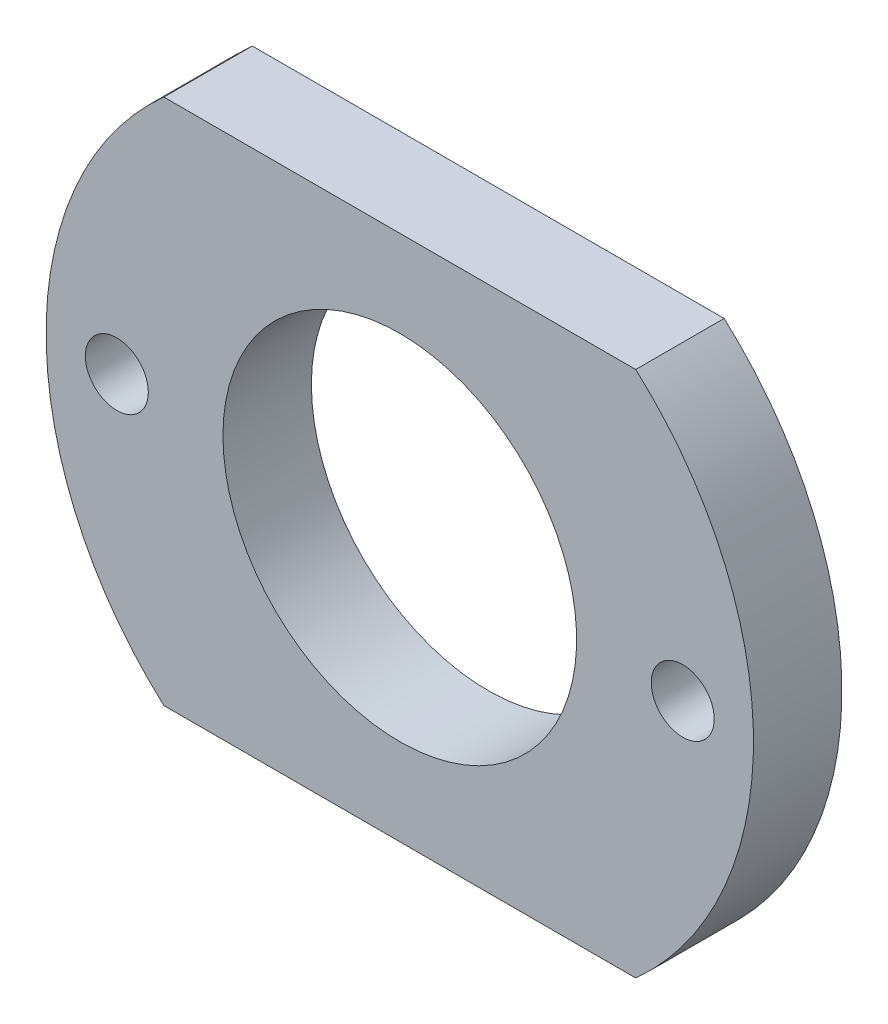
ISO-10303-21;
HEADER;
FILE_DESCRIPTION(('STEP AP214'),'2;1');
FILE_NAME('part.step','',(''),(''),'','','');
FILE_SCHEMA(('AUTOMOTIVE_DESIGN { 1 0 10303 214 1 1 1 1 }'));
ENDSEC;
DATA;
#1=APPLICATION_CONTEXT('core data for automotive mechanical design processes');
#2=APPLICATION_PROTOCOL_DEFINITION('international standard','automotive_design',2000,#1);
#3=PRODUCT_CONTEXT('',#1,'mechanical');
#4=PRODUCT('Part','Part','',(#3));
#5=PRODUCT_RELATED_PRODUCT_CATEGORY('part','',(#4));
#6=PRODUCT_DEFINITION_FORMATION('','',#4);
#7=PRODUCT_DEFINITION_CONTEXT('part definition',#1,'design');
#8=PRODUCT_DEFINITION('design','',#6,#7);
#9=PRODUCT_DEFINITION_SHAPE('','',#8);
#10=(LENGTH_UNIT() NAMED_UNIT(*) SI_UNIT(.MILLI.,.METRE.));
#11=(NAMED_UNIT(*) PLANE_ANGLE_UNIT() SI_UNIT($,.RADIAN.));
#12=(NAMED_UNIT(*) SI_UNIT($,.STERADIAN.) SOLID_ANGLE_UNIT());
#13=UNCERTAINTY_MEASURE_WITH_UNIT(LENGTH_MEASURE(1.E-05),#10,'distance_accuracy_value','');
#14=(GEOMETRIC_REPRESENTATION_CONTEXT(3) GLOBAL_UNCERTAINTY_ASSIGNED_CONTEXT((#13)) GLOBAL_UNIT_ASSIGNED_CONTEXT((#10,
#11,#12)) REPRESENTATION_CONTEXT('',''));
#15=CARTESIAN_POINT('',(0.,0.,0.));
#16=DIRECTION('',(0.,0.,1.));
#17=DIRECTION('',(1.,0.,0.));
#18=AXIS2_PLACEMENT_3D('',#15,#16,#17);
#19=CARTESIAN_POINT('',(0.,0.,3.175));
#20=DIRECTION('',(0.,0.,1.));
#21=DIRECTION('',(1.,0.,0.));
#22=AXIS2_PLACEMENT_3D('',#19,#20,#21);
#23=PLANE('',#22);
#24=CARTESIAN_POINT('',(0.,0.,3.175));
#25=DIRECTION('',(0.,0.,-1.));
#26=DIRECTION('',(-1.,0.,0.));
#27=AXIS2_PLACEMENT_3D('',#24,#25,#26);
#28=CIRCLE('',#27,6.35);
#29=CARTESIAN_POINT('',(-6.35,0.,3.175));
#30=VERTEX_POINT('',#29);
#31=EDGE_CURVE('E98',#30,#30,#28,.T.);
#32=ORIENTED_EDGE('',*,*,#31,.T.);
#33=EDGE_LOOP('',(#32));
#34=FACE_BOUND('',#33,.T.);
#35=CARTESIAN_POINT('',(0.,0.,3.175));
#36=DIRECTION('',(0.,0.,-1.));
#37=DIRECTION('',(-1.,0.,0.));
#38=AXIS2_PLACEMENT_3D('',#35,#36,#37);
#39=CIRCLE('',#38,12.7);
#40=CARTESIAN_POINT('',(8.47171870106651,9.4615,3.175));
#41=VERTEX_POINT('',#40);
#42=CARTESIAN_POINT('',(8.47171870106651,-9.4615,3.175));
#43=VERTEX_POINT('',#42);
#44=EDGE_CURVE('E55',#41,#43,#39,.T.);
#45=ORIENTED_EDGE('',*,*,#44,.F.);
#46=DIRECTION('',(1.,0.,0.));
#47=VECTOR('',#46,1.);
#48=CARTESIAN_POINT('',(-8.47171870106651,9.4615,3.175));
#49=LINE('',#48,#47);
#50=CARTESIAN_POINT('',(-8.47171870106651,9.4615,3.175));
#51=VERTEX_POINT('',#50);
#52=EDGE_CURVE('E66',#41,#51,#49,.F.);
#53=ORIENTED_EDGE('',*,*,#52,.T.);
#54=CARTESIAN_POINT('',(0.,0.,3.175));
#55=DIRECTION('',(0.,0.,-1.));
#56=DIRECTION('',(-1.,0.,0.));
#57=AXIS2_PLACEMENT_3D('',#54,#55,#56);
#58=CIRCLE('',#57,12.7);
#59=CARTESIAN_POINT('',(-8.47171870106651,-9.4615,3.175));
#60=VERTEX_POINT('',#59);
#61=EDGE_CURVE('E60',#60,#51,#58,.T.);
#62=ORIENTED_EDGE('',*,*,#61,.F.);
#63=DIRECTION('',(1.,0.,0.));
#64=VECTOR('',#63,1.);
#65=CARTESIAN_POINT('',(-8.47171870106651,-9.4615,3.175));
#66=LINE('',#65,#64);
#67=EDGE_CURVE('E63',#60,#43,#66,.T.);
#68=ORIENTED_EDGE('',*,*,#67,.T.);
#69=EDGE_LOOP('',(#45,#53,#62,#68));
#70=FACE_BOUND('',#69,.T.);
#71=CARTESIAN_POINT('',(-10.16,0.,3.175));
#72=DIRECTION('',(0.,0.,1.));
#73=DIRECTION('',(1.,0.,0.));
#74=AXIS2_PLACEMENT_3D('',#71,#72,#73);
#75=CIRCLE('',#74,1.1303);
#76=CARTESIAN_POINT('',(-9.0297,0.,3.175));
#77=VERTEX_POINT('',#76);
#78=EDGE_CURVE('E79',#77,#77,#75,.F.);
#79=ORIENTED_EDGE('',*,*,#78,.T.);
#80=EDGE_LOOP('',(#79));
#81=FACE_BOUND('',#80,.T.);
#82=CARTESIAN_POINT('',(10.16,0.,3.175));
#83=DIRECTION('',(0.,0.,1.));
#84=DIRECTION('',(1.,0.,0.));
#85=AXIS2_PLACEMENT_3D('',#82,#83,#84);
#86=CIRCLE('',#85,1.1303);
#87=CARTESIAN_POINT('',(11.2903,0.,3.175));
#88=VERTEX_POINT('',#87);
#89=EDGE_CURVE('E20',#88,#88,#86,.F.);
#90=ORIENTED_EDGE('',*,*,#89,.T.);
#91=EDGE_LOOP('',(#90));
#92=FACE_BOUND('',#91,.T.);
#93=ADVANCED_FACE('F17',(#34,#70,#81,#92),#23,.T.);
#94=CARTESIAN_POINT('',(10.16,0.,3.175));
#95=DIRECTION('',(0.,0.,1.));
#96=DIRECTION('',(1.,0.,0.));
#97=AXIS2_PLACEMENT_3D('',#94,#95,#96);
#98=CYLINDRICAL_SURFACE('',#97,1.1303);
#99=CARTESIAN_POINT('',(10.16,0.,0.));
#100=DIRECTION('',(0.,0.,1.));
#101=DIRECTION('',(1.,0.,0.));
#102=AXIS2_PLACEMENT_3D('',#99,#100,#101);
#103=CIRCLE('',#102,1.1303);
#104=CARTESIAN_POINT('',(11.2903,0.,0.));
#105=VERTEX_POINT('',#104);
#106=EDGE_CURVE('E95',#105,#105,#103,.F.);
#107=ORIENTED_EDGE('',*,*,#106,.T.);
#108=EDGE_LOOP('',(#107));
#109=FACE_BOUND('',#108,.T.);
#110=ORIENTED_EDGE('',*,*,#89,.F.);
#111=EDGE_LOOP('',(#110));
#112=FACE_BOUND('',#111,.T.);
#113=ADVANCED_FACE('F178',(#109,#112),#98,.F.);
#114=CARTESIAN_POINT('',(-10.16,0.,3.175));
#115=DIRECTION('',(0.,0.,1.));
#116=DIRECTION('',(1.,0.,0.));
#117=AXIS2_PLACEMENT_3D('',#114,#115,#116);
#118=CYLINDRICAL_SURFACE('',#117,1.1303);
#119=CARTESIAN_POINT('',(-10.16,0.,0.));
#120=DIRECTION('',(0.,0.,1.));
#121=DIRECTION('',(1.,0.,0.));
#122=AXIS2_PLACEMENT_3D('',#119,#120,#121);
#123=CIRCLE('',#122,1.1303);
#124=CARTESIAN_POINT('',(-9.0297,0.,0.));
#125=VERTEX_POINT('',#124);
#126=EDGE_CURVE('E92',#125,#125,#123,.F.);
#127=ORIENTED_EDGE('',*,*,#126,.T.);
#128=EDGE_LOOP('',(#127));
#129=FACE_BOUND('',#128,.T.);
#130=ORIENTED_EDGE('',*,*,#78,.F.);
#131=EDGE_LOOP('',(#130));
#132=FACE_BOUND('',#131,.T.);
#133=ADVANCED_FACE('F119',(#129,#132),#118,.F.);
#134=CARTESIAN_POINT('',(-8.47171870106651,-9.4615,3.175));
#135=DIRECTION('',(0.,1.,0.));
#136=DIRECTION('',(0.,0.,1.));
#137=AXIS2_PLACEMENT_3D('',#134,#135,#136);
#138=PLANE('',#137);
#139=DIRECTION('',(0.,0.,-1.));
#140=VECTOR('',#139,1.);
#141=CARTESIAN_POINT('',(8.47171870106651,-9.4615,3.175));
#142=LINE('',#141,#140);
#143=CARTESIAN_POINT('',(8.47171870106651,-9.4615,0.));
#144=VERTEX_POINT('',#143);
#145=EDGE_CURVE('E76',#43,#144,#142,.T.);
#146=ORIENTED_EDGE('',*,*,#145,.F.);
#147=ORIENTED_EDGE('',*,*,#67,.F.);
#148=DIRECTION('',(0.,0.,1.));
#149=VECTOR('',#148,1.);
#150=CARTESIAN_POINT('',(-8.47171870106651,-9.4615,3.175));
#151=LINE('',#150,#149);
#152=CARTESIAN_POINT('',(-8.47171870106651,-9.4615,0.));
#153=VERTEX_POINT('',#152);
#154=EDGE_CURVE('E75',#153,#60,#151,.T.);
#155=ORIENTED_EDGE('',*,*,#154,.F.);
#156=DIRECTION('',(1.,0.,0.));
#157=VECTOR('',#156,1.);
#158=CARTESIAN_POINT('',(0.,-9.4615,0.));
#159=LINE('',#158,#157);
#160=EDGE_CURVE('E90',#153,#144,#159,.T.);
#161=ORIENTED_EDGE('',*,*,#160,.T.);
#162=EDGE_LOOP('',(#146,#147,#155,#161));
#163=FACE_BOUND('',#162,.T.);
#164=ADVANCED_FACE('F73',(#163),#138,.F.);
#165=CARTESIAN_POINT('',(0.,0.,3.175));
#166=DIRECTION('',(0.,0.,-1.));
#167=DIRECTION('',(-1.,0.,0.));
#168=AXIS2_PLACEMENT_3D('',#165,#166,#167);
#169=CYLINDRICAL_SURFACE('',#168,12.7);
#170=ORIENTED_EDGE('',*,*,#44,.T.);
#171=ORIENTED_EDGE('',*,*,#145,.T.);
#172=CARTESIAN_POINT('',(0.,0.,0.));
#173=DIRECTION('',(0.,0.,-1.));
#174=DIRECTION('',(-1.,0.,0.));
#175=AXIS2_PLACEMENT_3D('',#172,#173,#174);
#176=CIRCLE('',#175,12.7);
#177=CARTESIAN_POINT('',(8.47171870106651,9.4615,0.));
#178=VERTEX_POINT('',#177);
#179=EDGE_CURVE('E87',#144,#178,#176,.F.);
#180=ORIENTED_EDGE('',*,*,#179,.T.);
#181=DIRECTION('',(0.,0.,-1.));
#182=VECTOR('',#181,1.);
#183=CARTESIAN_POINT('',(8.47171870106651,9.4615,3.175));
#184=LINE('',#183,#182);
#185=EDGE_CURVE('E85',#178,#41,#184,.F.);
#186=ORIENTED_EDGE('',*,*,#185,.T.);
#187=EDGE_LOOP('',(#170,#171,#180,#186));
#188=FACE_BOUND('',#187,.T.);
#189=ADVANCED_FACE('F110',(#188),#169,.T.);
#190=CARTESIAN_POINT('',(-8.47171870106651,9.4615,3.175));
#191=DIRECTION('',(0.,-1.,0.));
#192=DIRECTION('',(0.,0.,-1.));
#193=AXIS2_PLACEMENT_3D('',#190,#191,#192);
#194=PLANE('',#193);
#195=DIRECTION('',(0.,0.,-1.));
#196=VECTOR('',#195,1.);
#197=CARTESIAN_POINT('',(-8.47171870106651,9.4615,3.175));
#198=LINE('',#197,#196);
#199=CARTESIAN_POINT('',(-8.47171870106651,9.4615,0.));
#200=VERTEX_POINT('',#199);
#201=EDGE_CURVE('E70',#51,#200,#198,.T.);
#202=ORIENTED_EDGE('',*,*,#201,.F.);
#203=ORIENTED_EDGE('',*,*,#52,.F.);
#204=ORIENTED_EDGE('',*,*,#185,.F.);
#205=DIRECTION('',(1.,0.,0.));
#206=VECTOR('',#205,1.);
#207=CARTESIAN_POINT('',(0.,9.4615,0.));
#208=LINE('',#207,#206);
#209=EDGE_CURVE('E26',#178,#200,#208,.F.);
#210=ORIENTED_EDGE('',*,*,#209,.T.);
#211=EDGE_LOOP('',(#202,#203,#204,#210));
#212=FACE_BOUND('',#211,.T.);
#213=ADVANCED_FACE('F107',(#212),#194,.F.);
#214=CARTESIAN_POINT('',(0.,0.,3.175));
#215=DIRECTION('',(0.,0.,-1.));
#216=DIRECTION('',(-1.,0.,0.));
#217=AXIS2_PLACEMENT_3D('',#214,#215,#216);
#218=CYLINDRICAL_SURFACE('',#217,12.7);
#219=ORIENTED_EDGE('',*,*,#201,.T.);
#220=CARTESIAN_POINT('',(0.,0.,0.));
#221=DIRECTION('',(0.,0.,-1.));
#222=DIRECTION('',(-1.,0.,0.));
#223=AXIS2_PLACEMENT_3D('',#220,#221,#222);
#224=CIRCLE('',#223,12.7);
#225=EDGE_CURVE('E35',#200,#153,#224,.F.);
#226=ORIENTED_EDGE('',*,*,#225,.T.);
#227=ORIENTED_EDGE('',*,*,#154,.T.);
#228=ORIENTED_EDGE('',*,*,#61,.T.);
#229=EDGE_LOOP('',(#219,#226,#227,#228));
#230=FACE_BOUND('',#229,.T.);
#231=ADVANCED_FACE('F78',(#230),#218,.T.);
#232=CARTESIAN_POINT('',(0.,0.,3.175));
#233=DIRECTION('',(0.,0.,-1.));
#234=DIRECTION('',(-1.,0.,0.));
#235=AXIS2_PLACEMENT_3D('',#232,#233,#234);
#236=CYLINDRICAL_SURFACE('',#235,6.35);
#237=CARTESIAN_POINT('',(0.,0.,0.));
#238=DIRECTION('',(0.,0.,-1.));
#239=DIRECTION('',(-1.,0.,0.));
#240=AXIS2_PLACEMENT_3D('',#237,#238,#239);
#241=CIRCLE('',#240,6.35);
#242=CARTESIAN_POINT('',(-6.35,0.,0.));
#243=VERTEX_POINT('',#242);
#244=EDGE_CURVE('E11',#243,#243,#241,.T.);
#245=ORIENTED_EDGE('',*,*,#244,.T.);
#246=EDGE_LOOP('',(#245));
#247=FACE_BOUND('',#246,.T.);
#248=ORIENTED_EDGE('',*,*,#31,.F.);
#249=EDGE_LOOP('',(#248));
#250=FACE_BOUND('',#249,.T.);
#251=ADVANCED_FACE('F122',(#247,#250),#236,.F.);
#252=CARTESIAN_POINT('',(0.,0.,0.));
#253=DIRECTION('',(0.,0.,1.));
#254=DIRECTION('',(1.,0.,0.));
#255=AXIS2_PLACEMENT_3D('',#252,#253,#254);
#256=PLANE('',#255);
#257=ORIENTED_EDGE('',*,*,#244,.F.);
#258=EDGE_LOOP('',(#257));
#259=FACE_BOUND('',#258,.T.);
#260=ORIENTED_EDGE('',*,*,#209,.F.);
#261=ORIENTED_EDGE('',*,*,#179,.F.);
#262=ORIENTED_EDGE('',*,*,#160,.F.);
#263=ORIENTED_EDGE('',*,*,#225,.F.);
#264=EDGE_LOOP('',(#260,#261,#262,#263));
#265=FACE_BOUND('',#264,.T.);
#266=ORIENTED_EDGE('',*,*,#126,.F.);
#267=EDGE_LOOP('',(#266));
#268=FACE_BOUND('',#267,.T.);
#269=ORIENTED_EDGE('',*,*,#106,.F.);
#270=EDGE_LOOP('',(#269));
#271=FACE_BOUND('',#270,.T.);
#272=ADVANCED_FACE('F108',(#259,#265,#268,#271),#256,.F.);
#273=CLOSED_SHELL('',(#93,#113,#133,#164,#189,#213,#231,#251,#272));
#274=MANIFOLD_SOLID_BREP('B1',#273);
#275=ADVANCED_BREP_SHAPE_REPRESENTATION('',(#18,#274),#14);
#276=SHAPE_DEFINITION_REPRESENTATION(#9,#275);
ENDSEC;
END-ISO-10303-21;
